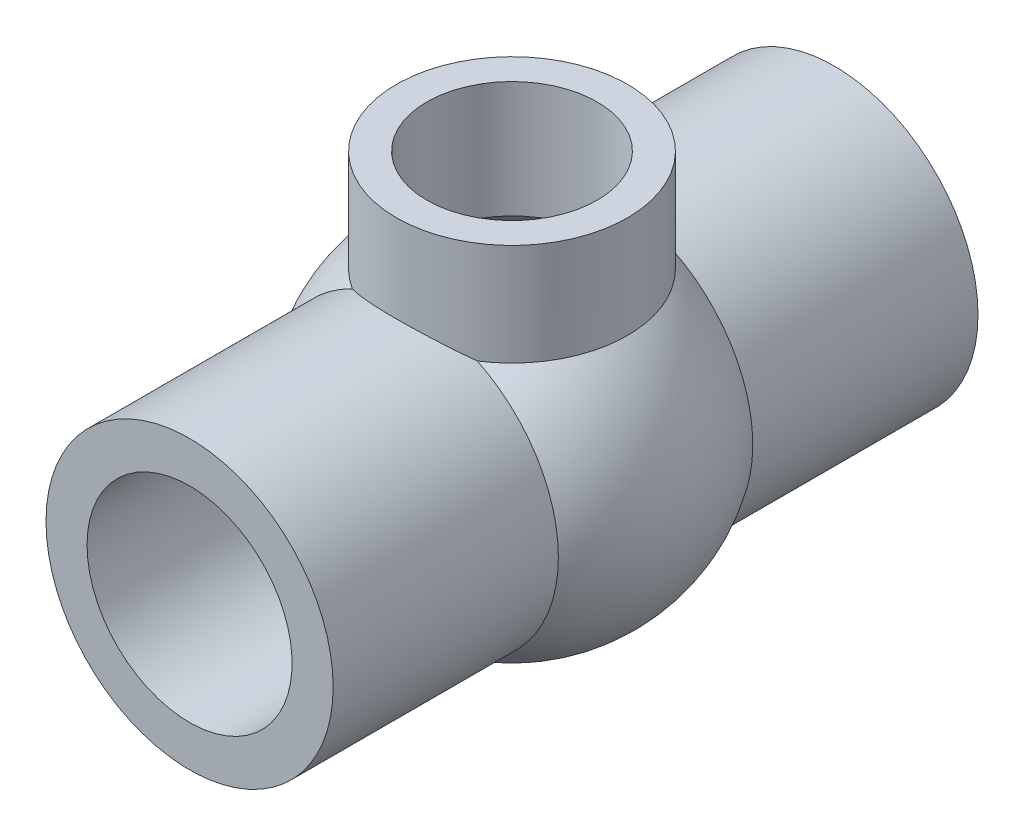
ISO-10303-21;
HEADER;
FILE_DESCRIPTION(('STEP AP214'),'2;1');
FILE_NAME('part.step','',(''),(''),'','','');
FILE_SCHEMA(('AUTOMOTIVE_DESIGN { 1 0 10303 214 1 1 1 1 }'));
ENDSEC;
DATA;
#1=APPLICATION_CONTEXT('core data for automotive mechanical design processes');
#2=APPLICATION_PROTOCOL_DEFINITION('international standard','automotive_design',2000,#1);
#3=PRODUCT_CONTEXT('',#1,'mechanical');
#4=PRODUCT('Part','Part','',(#3));
#5=PRODUCT_RELATED_PRODUCT_CATEGORY('part','',(#4));
#6=PRODUCT_DEFINITION_FORMATION('','',#4);
#7=PRODUCT_DEFINITION_CONTEXT('part definition',#1,'design');
#8=PRODUCT_DEFINITION('design','',#6,#7);
#9=PRODUCT_DEFINITION_SHAPE('','',#8);
#10=(LENGTH_UNIT() NAMED_UNIT(*) SI_UNIT(.MILLI.,.METRE.));
#11=(NAMED_UNIT(*) PLANE_ANGLE_UNIT() SI_UNIT($,.RADIAN.));
#12=(NAMED_UNIT(*) SI_UNIT($,.STERADIAN.) SOLID_ANGLE_UNIT());
#13=UNCERTAINTY_MEASURE_WITH_UNIT(LENGTH_MEASURE(1.E-05),#10,'distance_accuracy_value','');
#14=(GEOMETRIC_REPRESENTATION_CONTEXT(3) GLOBAL_UNCERTAINTY_ASSIGNED_CONTEXT((#13)) GLOBAL_UNIT_ASSIGNED_CONTEXT((#10,
#11,#12)) REPRESENTATION_CONTEXT('',''));
#15=CARTESIAN_POINT('',(0.,0.,0.));
#16=DIRECTION('',(0.,0.,1.));
#17=DIRECTION('',(1.,0.,0.));
#18=AXIS2_PLACEMENT_3D('',#15,#16,#17);
#19=CARTESIAN_POINT('',(9.46564700218448E-08,24.25880268062,-11.8369969783752));
#20=DIRECTION('',(0.,-1.,0.));
#21=DIRECTION('',(0.,0.,-1.));
#22=AXIS2_PLACEMENT_3D('',#19,#20,#21);
#23=PLANE('',#22);
#24=CARTESIAN_POINT('',(9.46564700218448E-08,24.25880268062,3.02162483085456E-06));
#25=DIRECTION('',(0.,1.,0.));
#26=DIRECTION('',(0.,0.,1.));
#27=AXIS2_PLACEMENT_3D('',#24,#25,#26);
#28=CIRCLE('',#27,11.837);
#29=CARTESIAN_POINT('',(9.46564700218448E-08,24.25880268062,11.8370030216248));
#30=VERTEX_POINT('',#29);
#31=EDGE_CURVE('E81',#30,#30,#28,.T.);
#32=ORIENTED_EDGE('',*,*,#31,.T.);
#33=EDGE_LOOP('',(#32));
#34=FACE_BOUND('',#33,.T.);
#35=CARTESIAN_POINT('',(9.46564700218448E-08,24.25880268062,3.02162483085456E-06));
#36=DIRECTION('',(0.,1.,0.));
#37=DIRECTION('',(0.,0.,1.));
#38=AXIS2_PLACEMENT_3D('',#35,#36,#37);
#39=CIRCLE('',#38,8.722);
#40=CARTESIAN_POINT('',(9.46564700218448E-08,24.25880268062,8.72200302162483));
#41=VERTEX_POINT('',#40);
#42=EDGE_CURVE('E134',#41,#41,#39,.T.);
#43=ORIENTED_EDGE('',*,*,#42,.F.);
#44=EDGE_LOOP('',(#43));
#45=FACE_BOUND('',#44,.T.);
#46=ADVANCED_FACE('F39',(#34,#45),#23,.F.);
#47=CARTESIAN_POINT('',(9.46564700218448E-08,0.584802680619981,-33.0189969783752));
#48=DIRECTION('',(0.,0.,-1.));
#49=DIRECTION('',(-1.,0.,0.));
#50=AXIS2_PLACEMENT_3D('',#47,#48,#49);
#51=CYLINDRICAL_SURFACE('',#50,7.7875);
#52=CARTESIAN_POINT('',(9.46564700218448E-08,0.584802680619981,-15.5749969783752));
#53=DIRECTION('',(0.,0.,-1.));
#54=DIRECTION('',(-1.,0.,0.));
#55=AXIS2_PLACEMENT_3D('',#52,#53,#54);
#56=CIRCLE('',#55,7.7875);
#57=CARTESIAN_POINT('',(-7.78749990534353,0.584802680619981,-15.5749969783752));
#58=VERTEX_POINT('',#57);
#59=EDGE_CURVE('E150',#58,#58,#56,.T.);
#60=ORIENTED_EDGE('',*,*,#59,.T.);
#61=EDGE_LOOP('',(#60));
#62=FACE_BOUND('',#61,.T.);
#63=CARTESIAN_POINT('',(9.46564700218448E-08,0.584802680619981,-12.3975404447237));
#64=DIRECTION('',(0.,0.,1.));
#65=DIRECTION('',(1.,0.,0.));
#66=AXIS2_PLACEMENT_3D('',#63,#64,#65);
#67=CIRCLE('',#66,7.7875);
#68=CARTESIAN_POINT('',(7.78750009465647,0.584802680619981,-12.3975404447237));
#69=VERTEX_POINT('',#68);
#70=EDGE_CURVE('E43',#69,#69,#67,.F.);
#71=ORIENTED_EDGE('',*,*,#70,.F.);
#72=EDGE_LOOP('',(#71));
#73=FACE_BOUND('',#72,.T.);
#74=ADVANCED_FACE('F123',(#62,#73),#51,.F.);
#75=CARTESIAN_POINT('',(9.46564700218448E-08,0.584802680619981,15.5750030216248));
#76=DIRECTION('',(0.,0.,-1.));
#77=DIRECTION('',(-1.,0.,0.));
#78=AXIS2_PLACEMENT_3D('',#75,#76,#77);
#79=CIRCLE('',#78,7.7875);
#80=CARTESIAN_POINT('',(-7.78749990534353,0.584802680619981,15.5750030216248));
#81=VERTEX_POINT('',#80);
#82=EDGE_CURVE('E147',#81,#81,#79,.T.);
#83=ORIENTED_EDGE('',*,*,#82,.F.);
#84=EDGE_LOOP('',(#83));
#85=FACE_BOUND('',#84,.T.);
#86=CARTESIAN_POINT('',(9.46564700218448E-08,0.584802680619981,12.3975464879733));
#87=DIRECTION('',(0.,0.,-1.));
#88=DIRECTION('',(-1.,0.,0.));
#89=AXIS2_PLACEMENT_3D('',#86,#87,#88);
#90=CIRCLE('',#89,7.7875);
#91=CARTESIAN_POINT('',(-7.78749990534353,0.584802680619981,12.3975464879733));
#92=VERTEX_POINT('',#91);
#93=EDGE_CURVE('E112',#92,#92,#90,.F.);
#94=ORIENTED_EDGE('',*,*,#93,.F.);
#95=EDGE_LOOP('',(#94));
#96=FACE_BOUND('',#95,.T.);
#97=ADVANCED_FACE('F120',(#85,#96),#51,.F.);
#98=CARTESIAN_POINT('',(9.46564700218448E-08,0.584802680619981,60.8751640437731));
#99=DIRECTION('',(0.,0.,1.));
#100=DIRECTION('',(1.,0.,0.));
#101=AXIS2_PLACEMENT_3D('',#98,#99,#100);
#102=CYLINDRICAL_SURFACE('',#101,14.7028);
#103=CARTESIAN_POINT('',(9.46564700218448E-08,0.584802680619981,-33.0189969783752));
#104=DIRECTION('',(0.,0.,1.));
#105=DIRECTION('',(1.,0.,0.));
#106=AXIS2_PLACEMENT_3D('',#103,#104,#105);
#107=CIRCLE('',#106,14.7028);
#108=CARTESIAN_POINT('',(14.7028000946565,0.584802680619981,-33.0189969783752));
#109=VERTEX_POINT('',#108);
#110=EDGE_CURVE('E48',#109,#109,#107,.T.);
#111=ORIENTED_EDGE('',*,*,#110,.T.);
#112=EDGE_LOOP('',(#111));
#113=FACE_BOUND('',#112,.T.);
#114=CARTESIAN_POINT('',(9.46564700218448E-08,15.28760268062,11.8370030216248));
#115=CARTESIAN_POINT('',(0.283808705634286,15.2876022117409,11.8370025396784));
#116=CARTESIAN_POINT('',(0.567624021275594,15.2793681875885,11.8267795929373));
#117=CARTESIAN_POINT('',(1.13296204156267,15.2466218126209,11.786067950437));
#118=CARTESIAN_POINT('',(1.41448370397799,15.2221024384421,11.7555705109159));
#119=CARTESIAN_POINT('',(1.97327637209859,15.1573025545792,11.6747867710097));
#120=CARTESIAN_POINT('',(2.2505399781478,15.1169972620206,11.624469353823));
#121=CARTESIAN_POINT('',(2.79829456637059,15.0215325357975,11.5049021725606));
#122=CARTESIAN_POINT('',(3.06878612982952,14.9663743818547,11.4356540395464));
#123=CARTESIAN_POINT('',(3.59961799816797,14.8427439480265,11.2797799729303));
#124=CARTESIAN_POINT('',(3.86001158221938,14.7743578653327,11.1932664359468));
#125=CARTESIAN_POINT('',(4.37108318677141,14.6253447925978,11.0037519742995));
#126=CARTESIAN_POINT('',(4.62176120791297,14.5447178033642,10.9007510507233));
#127=CARTESIAN_POINT('',(5.11234156026362,14.3726182465338,10.679466367475));
#128=CARTESIAN_POINT('',(5.35224551698693,14.2811473226237,10.5611849237287));
#129=CARTESIAN_POINT('',(5.82061531048152,14.0887612820144,10.31046363206));
#130=CARTESIAN_POINT('',(6.04907877876074,13.9878442220145,10.1780208700077));
#131=CARTESIAN_POINT('',(6.5722250729289,13.7411182346699,9.8512002688795));
#132=CARTESIAN_POINT('',(6.86197913834814,13.5919921898443,9.65140848655999));
#133=CARTESIAN_POINT('',(7.41893530504116,13.282569881491,9.23016963419127));
#134=CARTESIAN_POINT('',(7.68613008536966,13.1222700224089,9.00871558424016));
#135=CARTESIAN_POINT('',(8.19824895036711,12.7935637502363,8.54534371102611));
#136=CARTESIAN_POINT('',(8.44311266268388,12.6251371403327,8.30337363872808));
#137=CARTESIAN_POINT('',(8.90957553687097,12.2841718877127,7.80074662468107));
#138=CARTESIAN_POINT('',(9.13117738731578,12.111633723039,7.54009184835821));
#139=CARTESIAN_POINT('',(9.55434483794059,11.7634906980284,6.9964052714562));
#140=CARTESIAN_POINT('',(9.75553111908839,11.5878811229385,6.71308112871252));
#141=CARTESIAN_POINT('',(10.1333714000861,11.2409226427811,6.12786881133842));
#142=CARTESIAN_POINT('',(10.3100175356257,11.0695751179363,5.82597473016568));
#143=CARTESIAN_POINT('',(10.6373967498994,10.7372576401059,5.20417727127036));
#144=CARTESIAN_POINT('',(10.7881987621894,10.576260819841,4.88432492098199));
#145=CARTESIAN_POINT('',(11.0627736168144,10.2713608484233,4.22574644809477));
#146=CARTESIAN_POINT('',(11.1865696486431,10.1274430806469,3.88703683409483));
#147=CARTESIAN_POINT('',(11.4202462194479,9.84699663233803,3.14096203190057));
#148=CARTESIAN_POINT('',(11.5257160099681,9.7143587373478,2.73064342108747));
#149=CARTESIAN_POINT('',(11.6512672750039,9.55279906463435,2.09965408299069));
#150=CARTESIAN_POINT('',(11.6876619459316,9.50519815646324,1.8868872317873));
#151=CARTESIAN_POINT('',(11.7489820638734,9.42427876510511,1.45706894545404));
#152=CARTESIAN_POINT('',(11.7739133013241,9.39095307177079,1.24001973135424));
#153=CARTESIAN_POINT('',(11.8119505098967,9.33986947276808,0.80089730124088));
#154=CARTESIAN_POINT('',(11.82493952196,9.32226558932172,0.578795780647014));
#155=CARTESIAN_POINT('',(11.838342239623,9.30409825359001,0.133517241863857));
#156=CARTESIAN_POINT('',(11.8387566297471,9.3035338737257,-0.0896597171203217));
#157=CARTESIAN_POINT('',(11.8269954308411,9.31948088860525,-0.535205740549537));
#158=CARTESIAN_POINT('',(11.814811645745,9.33600339966543,-0.757574184488828));
#159=CARTESIAN_POINT('',(11.7781580388935,9.38527144884505,-1.19947531572197));
#160=CARTESIAN_POINT('',(11.7536865124387,9.41801923791677,-1.41900760521552));
#161=CARTESIAN_POINT('',(11.6885458505343,9.50408215980732,-1.88569027553334));
#162=CARTESIAN_POINT('',(11.6460234071772,9.55971433873336,-2.13215227176159));
#163=CARTESIAN_POINT('',(11.546566650573,9.68731026724855,-2.61779444441229));
#164=CARTESIAN_POINT('',(11.4896293237686,9.75927743148311,-2.85697308645825));
#165=CARTESIAN_POINT('',(11.3622171746549,9.91660879880369,-3.32779222061071));
#166=CARTESIAN_POINT('',(11.2917104637527,10.0020044711906,-3.55941342243446));
#167=CARTESIAN_POINT('',(11.1381140964519,10.1831810827391,-4.01430185907268));
#168=CARTESIAN_POINT('',(11.0550199094961,10.2789657576309,-4.23756604975424));
#169=CARTESIAN_POINT('',(10.8318686981202,10.5288151207282,-4.78666017739817));
#170=CARTESIAN_POINT('',(10.6842716994143,10.6878336054065,-5.1071878046234));
#171=CARTESIAN_POINT('',(10.3637622986171,11.0163665711802,-5.72971294479066));
#172=CARTESIAN_POINT('',(10.1908377400049,11.1858860697949,-6.03170146014308));
#173=CARTESIAN_POINT('',(9.8203874973015,11.5299529197256,-6.61776474564301));
#174=CARTESIAN_POINT('',(9.62283248753742,11.7045060705459,-6.90181754333019));
#175=CARTESIAN_POINT('',(9.20378031800648,12.0537683256009,-7.45146639895967));
#176=CARTESIAN_POINT('',(8.982287221408,12.2284773983928,-7.71706557662172));
#177=CARTESIAN_POINT('',(8.50856188641325,12.5792241452384,-8.2368804351122));
#178=CARTESIAN_POINT('',(8.25560949138329,12.755145835039,-8.49051974367097));
#179=CARTESIAN_POINT('',(7.72463080648325,13.0988926256958,-8.97630569640252));
#180=CARTESIAN_POINT('',(7.4466007909683,13.2667165178029,-9.20844913663518));
#181=CARTESIAN_POINT('',(6.86652496117128,13.5899234822184,-9.64871092012902));
#182=CARTESIAN_POINT('',(6.56453457527914,13.7453336899715,-9.85688213127665));
#183=CARTESIAN_POINT('',(5.9368683639043,14.0401361274388,-10.2471712513416));
#184=CARTESIAN_POINT('',(5.61120306414345,14.1795354052523,-10.4293006327296));
#185=CARTESIAN_POINT('',(5.03345303908494,14.4015833147687,-10.7168741620688));
#186=CARTESIAN_POINT('',(4.78674217417165,14.4891049599204,-10.8294061558499));
#187=CARTESIAN_POINT('',(4.28288345266563,14.6524721910608,-11.0383762223009));
#188=CARTESIAN_POINT('',(4.02573820314143,14.728320671208,-11.1348182846897));
#189=CARTESIAN_POINT('',(3.50229730320667,14.8669420378764,-11.3103747199699));
#190=CARTESIAN_POINT('',(3.23600615350828,14.9297212513738,-11.3894974782867));
#191=CARTESIAN_POINT('',(2.69568313181164,15.0410017240823,-11.529338955079));
#192=CARTESIAN_POINT('',(2.42165106847806,15.0895026300316,-11.5900572182072));
#193=CARTESIAN_POINT('',(1.86617815008518,15.1714044536815,-11.6923936662989));
#194=CARTESIAN_POINT('',(1.58470437117172,15.2047191885241,-11.7339028578074));
#195=CARTESIAN_POINT('',(1.01804575617413,15.25507231279,-11.7965812927353));
#196=CARTESIAN_POINT('',(0.732860924981342,15.2721107236639,-11.817750562961));
#197=CARTESIAN_POINT('',(0.161249473428675,15.2894982832666,-11.8393531695803));
#198=CARTESIAN_POINT('',(-0.125176907526533,15.2898505178512,-11.8397903400621));
#199=CARTESIAN_POINT('',(-0.696828464939259,15.2738634064607,-11.8199285275477));
#200=CARTESIAN_POINT('',(-0.982053709649192,15.2575250221098,-11.7996307391891));
#201=CARTESIAN_POINT('',(-1.52437787185493,15.210676024185,-11.7413206576492));
#202=CARTESIAN_POINT('',(-1.781777585855,15.1815119554838,-11.7049905433351));
#203=CARTESIAN_POINT('',(-2.29185654189788,15.110160894374,-11.6158906060488));
#204=CARTESIAN_POINT('',(-2.54453610698599,15.067974796677,-11.5631219125286));
#205=CARTESIAN_POINT('',(-3.04373297751194,14.9713475340254,-11.4418611234125));
#206=CARTESIAN_POINT('',(-3.29024914991235,14.9169041339079,-11.3733661600299));
#207=CARTESIAN_POINT('',(-3.77582309688841,14.7967011518165,-11.2215143051509));
#208=CARTESIAN_POINT('',(-4.01488046543398,14.7309409550626,-11.1381566062341));
#209=CARTESIAN_POINT('',(-4.49754824395729,14.5852103913938,-10.9524920569922));
#210=CARTESIAN_POINT('',(-4.74067529364551,14.5046540129666,-10.849390424728));
#211=CARTESIAN_POINT('',(-5.21664684544434,14.3333637245987,-10.6287321298952));
#212=CARTESIAN_POINT('',(-5.449487596177,14.2426261436229,-10.5111702519178));
#213=CARTESIAN_POINT('',(-5.90407879241624,14.0523517926006,-10.2627208359955));
#214=CARTESIAN_POINT('',(-6.12583249803418,13.9528176332709,-10.131837250033));
#215=CARTESIAN_POINT('',(-6.55790411157741,13.7462455471507,-9.85768138390135));
#216=CARTESIAN_POINT('',(-6.76822043621667,13.6392065861357,-9.71440739559347));
#217=CARTESIAN_POINT('',(-7.21539368731654,13.3983273118407,-9.38844106754673));
#218=CARTESIAN_POINT('',(-7.44985116625177,13.2632202204315,-9.20338981756587));
#219=CARTESIAN_POINT('',(-7.90189502280209,12.9865205968494,-8.81831768510267));
#220=CARTESIAN_POINT('',(-8.11948456630202,12.8449292896509,-8.61829962560634));
#221=CARTESIAN_POINT('',(-8.53830563943585,12.5570373047859,-8.20359362487561));
#222=CARTESIAN_POINT('',(-8.73949010012449,12.4107246489844,-7.98886651507509));
#223=CARTESIAN_POINT('',(-9.12467509523861,12.1161259794849,-7.54592293801414));
#224=CARTESIAN_POINT('',(-9.30867940587725,11.9678404076611,-7.31770945316488));
#225=CARTESIAN_POINT('',(-9.69787522421546,11.6392935678869,-6.79657850066666));
#226=CARTESIAN_POINT('',(-9.89887338495601,11.4591461614386,-6.50044114284459));
#227=CARTESIAN_POINT('',(-10.274741320814,11.1047241653544,-5.88840014119555));
#228=CARTESIAN_POINT('',(-10.4495977890893,10.9304526014025,-5.57248654600721));
#229=CARTESIAN_POINT('',(-10.7714648554724,10.5948842427801,-4.92154233686032));
#230=CARTESIAN_POINT('',(-10.9185558333985,10.4335507977717,-4.58657067661223));
#231=CARTESIAN_POINT('',(-11.1834283115738,10.1317138698741,-3.89638060916038));
#232=CARTESIAN_POINT('',(-11.3012430723128,9.99118682306436,-3.54118574674614));
#233=CARTESIAN_POINT('',(-11.4579859767321,9.79862657687488,-2.97846303181043));
#234=CARTESIAN_POINT('',(-11.5083260191932,9.73554746730043,-2.77784061982679));
#235=CARTESIAN_POINT('',(-11.5989245924312,9.62043388792727,-2.37125388408934));
#236=CARTESIAN_POINT('',(-11.6391871325197,9.56839502705023,-2.16529172084982));
#237=CARTESIAN_POINT('',(-11.7089415796688,9.47728898989294,-1.74918215799195));
#238=CARTESIAN_POINT('',(-11.7384570793204,9.43819341702677,-1.53904500701798));
#239=CARTESIAN_POINT('',(-11.7862680146446,9.37444489553825,-1.11529940643102));
#240=CARTESIAN_POINT('',(-11.8045635868178,9.34979177121055,-0.901690999081486));
#241=CARTESIAN_POINT('',(-11.8296052410957,9.31596649263404,-0.471013080948931));
#242=CARTESIAN_POINT('',(-11.8362676777029,9.30690646370389,-0.253929738978737));
#243=CARTESIAN_POINT('',(-11.8376177273085,9.30507408872272,0.180336415214354));
#244=CARTESIAN_POINT('',(-11.832305707565,9.31230124314158,0.39751922418233));
#245=CARTESIAN_POINT('',(-11.8098289233899,9.34269151684485,0.830386332096552));
#246=CARTESIAN_POINT('',(-11.7926504492052,9.36587306871983,1.04606860598785));
#247=CARTESIAN_POINT('',(-11.7468308014751,9.42707263739816,1.47407424802946));
#248=CARTESIAN_POINT('',(-11.718187881909,9.46509291409886,1.68639709942129));
#249=CARTESIAN_POINT('',(-11.642352373702,9.564373013965,2.15362255025962));
#250=CARTESIAN_POINT('',(-11.5924387538565,9.6289341449467,2.40738094455584));
#251=CARTESIAN_POINT('',(-11.4774524587193,9.77441526551916,2.90660540935785));
#252=CARTESIAN_POINT('',(-11.4123754520275,9.85533992845511,3.15206908750651));
#253=CARTESIAN_POINT('',(-11.267988049912,10.0303124032001,3.63464302402665));
#254=CARTESIAN_POINT('',(-11.1886429160623,10.1243921162531,3.87173116635197));
#255=CARTESIAN_POINT('',(-11.0167381528607,10.3224110326384,4.33676555289854));
#256=CARTESIAN_POINT('',(-10.9241777854651,10.4263507865249,4.56471128562348));
#257=CARTESIAN_POINT('',(-10.6782314411143,10.6939497714492,5.12077215925111));
#258=CARTESIAN_POINT('',(-10.5172191149718,10.8619799004296,5.44342869250653));
#259=CARTESIAN_POINT('',(-10.1688783201889,11.2067803844078,6.06933727616363));
#260=CARTESIAN_POINT('',(-9.98153807413507,11.3835546278986,6.37258055347553));
#261=CARTESIAN_POINT('',(-9.58111862316684,11.740361631454,6.96011957670121));
#262=CARTESIAN_POINT('',(-9.36801178605447,11.9203977105033,7.24439446484878));
#263=CARTESIAN_POINT('',(-8.91662019420524,12.2787872776056,7.79324777677253));
#264=CARTESIAN_POINT('',(-8.67833964787169,12.4571410414856,8.0578294801816));
#265=CARTESIAN_POINT('',(-8.17164931891097,12.811576662573,8.57155397813277));
#266=CARTESIAN_POINT('',(-7.9027262578032,12.9875389729406,8.82027452584974));
#267=CARTESIAN_POINT('',(-7.33900624743759,13.3292112726812,9.2945834477532));
#268=CARTESIAN_POINT('',(-7.04420503711159,13.4949195659512,9.52016799908164));
#269=CARTESIAN_POINT('',(-6.43005078274666,13.8115130116085,9.94526128137093));
#270=CARTESIAN_POINT('',(-6.11075572214905,13.9624313560504,10.1448287496201));
#271=CARTESIAN_POINT('',(-5.4483007911902,14.2456192210069,10.5154407076129));
#272=CARTESIAN_POINT('',(-5.10515439161299,14.3778991423868,10.6865011150701));
#273=CARTESIAN_POINT('',(-4.50774986344785,14.5819013767169,10.9483115223322));
#274=CARTESIAN_POINT('',(-4.25918737200281,14.6596365212359,11.0474612717677));
#275=CARTESIAN_POINT('',(-3.75283948573051,14.8030198240439,11.2295665343171));
#276=CARTESIAN_POINT('',(-3.49505650852786,14.8686711233873,11.3125262561784));
#277=CARTESIAN_POINT('',(-2.97208118462149,14.9865654709546,11.4610259293069));
#278=CARTESIAN_POINT('',(-2.70690432634663,15.0388345092892,11.526599655419));
#279=CARTESIAN_POINT('',(-2.17039665408885,15.1290681240877,11.6395499883918));
#280=CARTESIAN_POINT('',(-1.89906820610543,15.1670381044679,11.6869334698622));
#281=CARTESIAN_POINT('',(-1.35747994132269,15.2272868230119,11.762021346565));
#282=CARTESIAN_POINT('',(-1.087304202465,15.2498596921093,11.7900947160768));
#283=CARTESIAN_POINT('',(-0.544754697876306,15.280019756651,11.8275881632514));
#284=CARTESIAN_POINT('',(-0.272380389400429,15.2876031306187,11.8370034841647));
#285=CARTESIAN_POINT('',(9.46564700218448E-08,15.28760268062,11.8370030216248));
#286=B_SPLINE_CURVE_WITH_KNOTS('',3,(#114,#115,#116,#117,#118,#119,#120,#121,#122,#123,#124,
#125,#126,#127,#128,#129,#130,#131,#132,#133,#134,#135,#136,#137,#138,#139,#140,#141,#142,#143,
#144,#145,#146,#147,#148,#149,#150,#151,#152,#153,#154,#155,#156,#157,#158,#159,#160,#161,#162,
#163,#164,#165,#166,#167,#168,#169,#170,#171,#172,#173,#174,#175,#176,#177,#178,#179,#180,#181,
#182,#183,#184,#185,#186,#187,#188,#189,#190,#191,#192,#193,#194,#195,#196,#197,#198,#199,#200,
#201,#202,#203,#204,#205,#206,#207,#208,#209,#210,#211,#212,#213,#214,#215,#216,#217,#218,#219,
#220,#221,#222,#223,#224,#225,#226,#227,#228,#229,#230,#231,#232,#233,#234,#235,#236,#237,#238,
#239,#240,#241,#242,#243,#244,#245,#246,#247,#248,#249,#250,#251,#252,#253,#254,#255,#256,#257,
#258,#259,#260,#261,#262,#263,#264,#265,#266,#267,#268,#269,#270,#271,#272,#273,#274,#275,#276,
#277,#278,#279,#280,#281,#282,#283,#284,#285),.UNSPECIFIED.,.T.,.F.,(4,2,2,2,2,2,2,2,2,2,2,2,2,
2,2,2,2,2,2,2,2,2,2,2,2,2,2,2,2,2,2,2,2,2,2,2,2,2,2,2,2,2,2,2,2,2,2,2,2,2,2,2,2,2,2,2,2,2,2,2,2,
2,2,2,2,2,2,2,2,2,2,2,2,2,2,2,2,2,2,2,2,2,2,2,2,4),(0.,0.851137219866172,1.70264174723382,
2.55548847515522,3.40826174534643,4.25565469339856,5.1030475855484,5.95031219660729,
6.79775149537137,7.94286528543693,9.08834927111746,10.2368435700476,11.3852049810669,
12.5520251663054,13.7192184207299,14.8832482784179,16.0462746379342,17.3729891777962,
18.0354567599739,18.6975893463466,19.36613968028,20.0346536202929,20.7036027530102,
21.3726447158395,22.1401149867069,22.9077458366177,23.6772031774906,24.4469381268277,
25.6063890935989,26.7663983992648,27.9278022741189,29.0890093249676,30.2848749978147,
31.4809186274354,32.6742718539919,33.8670977300475,34.7211194817288,35.5749291512553,
36.4283245159264,37.2817409928075,38.1399421629346,38.9981422020253,39.8561835293842,
40.7141754237719,41.4980318265947,42.2818343845524,43.0657799876326,43.8497681916587,
44.6772569555106,45.5050450515572,46.3325882899951,47.1602457958265,48.1428020387584,
49.1251734203479,50.1102708758838,51.0951512938144,52.2958582711938,53.4971743756365,
54.6949575199747,55.8913735856914,56.5396302720034,57.1876286394366,57.8341957784584,
58.4807550512472,59.1319444118235,59.783113800606,60.4350367704637,61.0870590651812,
61.8854879697845,62.6841452246865,63.4847739565405,64.2854474193823,65.4772247786066,
66.6695369692593,67.8631393343345,69.0565424742868,70.2741628314806,71.4919840581641,
72.7070064242372,73.9213480587806,74.7565676456176,75.5915698193266,76.4249377923259,
77.2579905011268,78.0746467873184,78.8915112480099),.UNSPECIFIED.);
#287=CARTESIAN_POINT('',(6.40539755226985,13.8189710054525,-9.9541645683849));
#288=VERTEX_POINT('',#287);
#289=CARTESIAN_POINT('',(-6.40539736295691,13.8189710054525,-9.9541645683849));
#290=VERTEX_POINT('',#289);
#291=EDGE_CURVE('E62',#288,#290,#286,.T.);
#292=ORIENTED_EDGE('',*,*,#291,.F.);
#293=CARTESIAN_POINT('',(9.46564700218448E-08,0.584802680619981,-9.9541645683849));
#294=DIRECTION('',(0.,0.,1.));
#295=DIRECTION('',(1.,0.,0.));
#296=AXIS2_PLACEMENT_3D('',#293,#294,#295);
#297=CIRCLE('',#296,14.7028);
#298=EDGE_CURVE('E72',#290,#288,#297,.T.);
#299=ORIENTED_EDGE('',*,*,#298,.F.);
#300=EDGE_LOOP('',(#292,#299));
#301=FACE_BOUND('',#300,.T.);
#302=ADVANCED_FACE('F92',(#113,#301),#102,.T.);
#303=CARTESIAN_POINT('',(9.46564700218448E-08,0.584802680619981,3.02162483085456E-06));
#304=DIRECTION('',(0.,0.,1.));
#305=DIRECTION('',(0.,1.,0.));
#306=AXIS2_PLACEMENT_3D('',#303,#304,#305);
#307=SPHERICAL_SURFACE('',#306,17.7555);
#308=CARTESIAN_POINT('',(9.46564700218448E-08,13.8189710054525,3.02162483085456E-06));
#309=DIRECTION('',(0.,1.,0.));
#310=DIRECTION('',(0.,0.,1.));
#311=AXIS2_PLACEMENT_3D('',#308,#309,#310);
#312=CIRCLE('',#311,11.837);
#313=CARTESIAN_POINT('',(-6.40539736295691,13.8189710054525,9.95417061163456));
#314=VERTEX_POINT('',#313);
#315=EDGE_CURVE('E56',#290,#314,#312,.T.);
#316=ORIENTED_EDGE('',*,*,#315,.F.);
#317=ORIENTED_EDGE('',*,*,#298,.T.);
#318=CARTESIAN_POINT('',(6.40539755226985,13.8189710054525,9.95417061163456));
#319=VERTEX_POINT('',#318);
#320=EDGE_CURVE('E76',#319,#288,#312,.T.);
#321=ORIENTED_EDGE('',*,*,#320,.F.);
#322=CARTESIAN_POINT('',(9.46564700218448E-08,0.584802680619981,9.95417061163456));
#323=DIRECTION('',(0.,0.,1.));
#324=DIRECTION('',(1.,0.,0.));
#325=AXIS2_PLACEMENT_3D('',#322,#323,#324);
#326=CIRCLE('',#325,14.7028);
#327=EDGE_CURVE('E69',#314,#319,#326,.T.);
#328=ORIENTED_EDGE('',*,*,#327,.F.);
#329=EDGE_LOOP('',(#316,#317,#321,#328));
#330=FACE_BOUND('',#329,.T.);
#331=ADVANCED_FACE('F77',(#330),#307,.T.);
#332=CARTESIAN_POINT('',(9.46564700218448E-08,0.584802680619981,60.8751640437731));
#333=DIRECTION('',(0.,0.,1.));
#334=DIRECTION('',(1.,0.,0.));
#335=AXIS2_PLACEMENT_3D('',#332,#333,#334);
#336=CYLINDRICAL_SURFACE('',#335,14.7028);
#337=CARTESIAN_POINT('',(9.46564700218448E-08,0.584802680619981,33.0190030216248));
#338=DIRECTION('',(0.,0.,1.));
#339=DIRECTION('',(1.,0.,0.));
#340=AXIS2_PLACEMENT_3D('',#337,#338,#339);
#341=CIRCLE('',#340,14.7028);
#342=CARTESIAN_POINT('',(14.7028000946565,0.584802680619981,33.0190030216248));
#343=VERTEX_POINT('',#342);
#344=EDGE_CURVE('E73',#343,#343,#341,.T.);
#345=ORIENTED_EDGE('',*,*,#344,.F.);
#346=EDGE_LOOP('',(#345));
#347=FACE_BOUND('',#346,.T.);
#348=CARTESIAN_POINT('',(-6.40539736295691,13.8189710054525,9.95417061163456));
#349=CARTESIAN_POINT('',(-6.17789197535221,13.9291072138062,10.1005781356925));
#350=CARTESIAN_POINT('',(-5.94386029606752,14.0351156555852,10.2401338510201));
#351=CARTESIAN_POINT('',(-5.46324807400695,14.2373896514425,10.5044172658424));
#352=CARTESIAN_POINT('',(-5.21665669530421,14.3336465708246,10.6291318407002));
#353=CARTESIAN_POINT('',(-4.71044058805306,14.5152299070496,10.8629893617297));
#354=CARTESIAN_POINT('',(-4.45075155873248,14.600493205193,10.9720427653208));
#355=CARTESIAN_POINT('',(-3.92080600970752,14.7578746703064,11.1723823654031));
#356=CARTESIAN_POINT('',(-3.65055229775841,14.829996301451,11.2636732445694));
#357=CARTESIAN_POINT('',(-3.0993533328173,14.9600228435323,11.4276758585502));
#358=CARTESIAN_POINT('',(-2.81835641249256,15.0178453493704,11.5002799961674));
#359=CARTESIAN_POINT('',(-2.24902121503415,15.1174464946655,11.6250359490023));
#360=CARTESIAN_POINT('',(-1.96068239887073,15.1592239524791,11.6771862578966));
#361=CARTESIAN_POINT('',(-1.37988007007848,15.2256163612467,11.7599466991188));
#362=CARTESIAN_POINT('',(-1.08743197412098,15.2502837113844,11.7906225988606));
#363=CARTESIAN_POINT('',(-0.500127672361541,15.2820355083144,11.8300932087706));
#364=CARTESIAN_POINT('',(-0.205271741679465,15.2891219364679,11.8388903846602));
#365=CARTESIAN_POINT('',(0.356838937242872,15.2857053509915,11.8346460745308));
#366=CARTESIAN_POINT('',(0.62412118715692,15.2767703847706,11.823551451585));
#367=CARTESIAN_POINT('',(1.15644089321322,15.2444773617481,11.7834000813542));
#368=CARTESIAN_POINT('',(1.4214784714985,15.2211200949094,11.7543443178676));
#369=CARTESIAN_POINT('',(1.94772847037338,15.1604307228925,11.678688034173));
#370=CARTESIAN_POINT('',(2.20893593663926,15.1230819362159,11.6320665707395));
#371=CARTESIAN_POINT('',(2.72549100450462,15.0351547137037,11.5219825024208));
#372=CARTESIAN_POINT('',(2.98083860826102,14.9845762827378,11.4585199037347));
#373=CARTESIAN_POINT('',(3.48253250728771,14.8715093508322,11.3161017268511));
#374=CARTESIAN_POINT('',(3.72892736306109,14.8091022748944,11.2372519656961));
#375=CARTESIAN_POINT('',(4.21342667153448,14.6731915276376,11.0647111982598));
#376=CARTESIAN_POINT('',(4.4515273960752,14.5996829434885,10.9710136203585));
#377=CARTESIAN_POINT('',(4.91804993535025,14.4428543704488,10.7699514703153));
#378=CARTESIAN_POINT('',(5.14648575484344,14.3595492888163,10.6626076439051));
#379=CARTESIAN_POINT('',(5.5933928658738,14.18421035417,10.4351065042682));
#380=CARTESIAN_POINT('',(5.81186499856764,14.0921772400238,10.3149502755627));
#381=CARTESIAN_POINT('',(6.08945243899346,13.9674737423989,10.1508028277747));
#382=CARTESIAN_POINT('',(6.15335244389899,13.9382098599802,10.1121927181041));
#383=CARTESIAN_POINT('',(6.28012663176729,13.8790579532261,10.0339513866688));
#384=CARTESIAN_POINT('',(6.34300180421849,13.8491706033261,9.99432125845218));
#385=CARTESIAN_POINT('',(6.40539755226985,13.8189710054525,9.95417061163456));
#386=B_SPLINE_CURVE_WITH_KNOTS('',3,(#348,#349,#350,#351,#352,#353,#354,#355,#356,#357,#358,
#359,#360,#361,#362,#363,#364,#365,#366,#367,#368,#369,#370,#371,#372,#373,#374,#375,#376,#377,
#378,#379,#380,#381,#382,#383,#384,#385),.UNSPECIFIED.,.F.,.F.,(4,2,2,2,2,2,2,2,2,2,2,2,2,2,2,2,
2,2,4),(0.,0.876264013498746,1.75329727389266,2.63516073926875,3.5167914059933,4.40339028359942,
5.29005444257728,6.1739910861552,7.05782810599087,7.85982021483503,8.66176839949041,
9.46467577192672,10.2675828488221,11.0651514658172,11.8630740764633,12.6597978341339,
13.4564542056241,13.6970123220569,13.9373224797864),.UNSPECIFIED.);
#387=EDGE_CURVE('E11',#314,#319,#386,.T.);
#388=ORIENTED_EDGE('',*,*,#387,.F.);
#389=ORIENTED_EDGE('',*,*,#327,.T.);
#390=EDGE_LOOP('',(#388,#389));
#391=FACE_BOUND('',#390,.T.);
#392=ADVANCED_FACE('F71',(#347,#391),#336,.T.);
#393=CARTESIAN_POINT('',(9.46564700218448E-08,15.28760268062,-33.0189969783752));
#394=DIRECTION('',(0.,0.,1.));
#395=DIRECTION('',(1.,0.,0.));
#396=AXIS2_PLACEMENT_3D('',#393,#394,#395);
#397=PLANE('',#396);
#398=CARTESIAN_POINT('',(9.46564700218448E-08,0.584802680619981,-33.0189969783752));
#399=DIRECTION('',(0.,0.,-1.));
#400=DIRECTION('',(-1.,0.,0.));
#401=AXIS2_PLACEMENT_3D('',#398,#399,#400);
#402=CIRCLE('',#401,10.49755);
#403=CARTESIAN_POINT('',(-10.4975499053435,0.584802680619981,-33.0189969783752));
#404=VERTEX_POINT('',#403);
#405=EDGE_CURVE('E83',#404,#404,#402,.T.);
#406=ORIENTED_EDGE('',*,*,#405,.F.);
#407=EDGE_LOOP('',(#406));
#408=FACE_BOUND('',#407,.T.);
#409=ORIENTED_EDGE('',*,*,#110,.F.);
#410=EDGE_LOOP('',(#409));
#411=FACE_BOUND('',#410,.T.);
#412=ADVANCED_FACE('F41',(#408,#411),#397,.F.);
#413=CARTESIAN_POINT('',(9.46564700218448E-08,15.28760268062,33.0190030216248));
#414=DIRECTION('',(0.,0.,-1.));
#415=DIRECTION('',(-1.,0.,0.));
#416=AXIS2_PLACEMENT_3D('',#413,#414,#415);
#417=PLANE('',#416);
#418=CARTESIAN_POINT('',(9.46564700218448E-08,0.584802680619981,33.0190030216248));
#419=DIRECTION('',(0.,0.,-1.));
#420=DIRECTION('',(-1.,0.,0.));
#421=AXIS2_PLACEMENT_3D('',#418,#419,#420);
#422=CIRCLE('',#421,10.49755);
#423=CARTESIAN_POINT('',(-10.4975499053435,0.584802680619981,33.0190030216248));
#424=VERTEX_POINT('',#423);
#425=EDGE_CURVE('E141',#424,#424,#422,.T.);
#426=ORIENTED_EDGE('',*,*,#425,.T.);
#427=EDGE_LOOP('',(#426));
#428=FACE_BOUND('',#427,.T.);
#429=ORIENTED_EDGE('',*,*,#344,.T.);
#430=EDGE_LOOP('',(#429));
#431=FACE_BOUND('',#430,.T.);
#432=ADVANCED_FACE('F100',(#428,#431),#417,.F.);
#433=CARTESIAN_POINT('',(9.46564700218448E-08,24.25880268062,3.02162483085456E-06));
#434=DIRECTION('',(0.,1.,0.));
#435=DIRECTION('',(0.,0.,1.));
#436=AXIS2_PLACEMENT_3D('',#433,#434,#435);
#437=CYLINDRICAL_SURFACE('',#436,11.837);
#438=ORIENTED_EDGE('',*,*,#31,.F.);
#439=EDGE_LOOP('',(#438));
#440=FACE_BOUND('',#439,.T.);
#441=ORIENTED_EDGE('',*,*,#320,.T.);
#442=ORIENTED_EDGE('',*,*,#291,.T.);
#443=ORIENTED_EDGE('',*,*,#315,.T.);
#444=ORIENTED_EDGE('',*,*,#387,.T.);
#445=EDGE_LOOP('',(#441,#442,#443,#444));
#446=FACE_BOUND('',#445,.T.);
#447=ADVANCED_FACE('F80',(#440,#446),#437,.T.);
#448=CARTESIAN_POINT('',(9.46564700218448E-08,0.584802680619981,-33.0189969783752));
#449=DIRECTION('',(0.,0.,-1.));
#450=DIRECTION('',(-1.,0.,0.));
#451=AXIS2_PLACEMENT_3D('',#448,#449,#450);
#452=CYLINDRICAL_SURFACE('',#451,10.49755);
#453=CARTESIAN_POINT('',(9.46564700218448E-08,0.584802680619981,-15.5749969783752));
#454=DIRECTION('',(0.,0.,-1.));
#455=DIRECTION('',(-1.,0.,0.));
#456=AXIS2_PLACEMENT_3D('',#453,#454,#455);
#457=CIRCLE('',#456,10.49755);
#458=CARTESIAN_POINT('',(-10.4975499053435,0.584802680619981,-15.5749969783752));
#459=VERTEX_POINT('',#458);
#460=EDGE_CURVE('E153',#459,#459,#457,.T.);
#461=ORIENTED_EDGE('',*,*,#460,.F.);
#462=EDGE_LOOP('',(#461));
#463=FACE_BOUND('',#462,.T.);
#464=ORIENTED_EDGE('',*,*,#405,.T.);
#465=EDGE_LOOP('',(#464));
#466=FACE_BOUND('',#465,.T.);
#467=ADVANCED_FACE('F99',(#463,#466),#452,.F.);
#468=CARTESIAN_POINT('',(9.46564700218448E-08,11.08235268062,-15.5749969783752));
#469=DIRECTION('',(0.,0.,1.));
#470=DIRECTION('',(1.,0.,0.));
#471=AXIS2_PLACEMENT_3D('',#468,#469,#470);
#472=PLANE('',#471);
#473=ORIENTED_EDGE('',*,*,#59,.F.);
#474=EDGE_LOOP('',(#473));
#475=FACE_BOUND('',#474,.T.);
#476=ORIENTED_EDGE('',*,*,#460,.T.);
#477=EDGE_LOOP('',(#476));
#478=FACE_BOUND('',#477,.T.);
#479=ADVANCED_FACE('F184',(#475,#478),#472,.F.);
#480=CARTESIAN_POINT('',(9.46564700218448E-08,11.08235268062,15.5750030216248));
#481=DIRECTION('',(0.,0.,-1.));
#482=DIRECTION('',(-1.,0.,0.));
#483=AXIS2_PLACEMENT_3D('',#480,#481,#482);
#484=PLANE('',#483);
#485=CARTESIAN_POINT('',(9.46564700218448E-08,0.584802680619981,15.5750030216248));
#486=DIRECTION('',(0.,0.,-1.));
#487=DIRECTION('',(-1.,0.,0.));
#488=AXIS2_PLACEMENT_3D('',#485,#486,#487);
#489=CIRCLE('',#488,10.49755);
#490=CARTESIAN_POINT('',(-10.4975499053435,0.584802680619981,15.5750030216248));
#491=VERTEX_POINT('',#490);
#492=EDGE_CURVE('E144',#491,#491,#489,.T.);
#493=ORIENTED_EDGE('',*,*,#492,.F.);
#494=EDGE_LOOP('',(#493));
#495=FACE_BOUND('',#494,.T.);
#496=ORIENTED_EDGE('',*,*,#82,.T.);
#497=EDGE_LOOP('',(#496));
#498=FACE_BOUND('',#497,.T.);
#499=ADVANCED_FACE('F178',(#495,#498),#484,.F.);
#500=CARTESIAN_POINT('',(9.46564700218448E-08,0.584802680619981,-33.0189969783752));
#501=DIRECTION('',(0.,0.,-1.));
#502=DIRECTION('',(-1.,0.,0.));
#503=AXIS2_PLACEMENT_3D('',#500,#501,#502);
#504=CYLINDRICAL_SURFACE('',#503,10.49755);
#505=ORIENTED_EDGE('',*,*,#425,.F.);
#506=EDGE_LOOP('',(#505));
#507=FACE_BOUND('',#506,.T.);
#508=ORIENTED_EDGE('',*,*,#492,.T.);
#509=EDGE_LOOP('',(#508));
#510=FACE_BOUND('',#509,.T.);
#511=ADVANCED_FACE('F174',(#507,#510),#504,.F.);
#512=CARTESIAN_POINT('',(9.46564700218448E-08,0.584802680619981,3.02162483085456E-06));
#513=DIRECTION('',(0.,1.,0.));
#514=DIRECTION('',(0.,0.,1.));
#515=AXIS2_PLACEMENT_3D('',#512,#513,#514);
#516=SPHERICAL_SURFACE('',#515,14.6405);
#517=ORIENTED_EDGE('',*,*,#93,.T.);
#518=EDGE_LOOP('',(#517));
#519=FACE_BOUND('',#518,.T.);
#520=CARTESIAN_POINT('',(9.46564700218448E-08,12.3436698135542,3.02162483085456E-06));
#521=DIRECTION('',(0.,1.,0.));
#522=DIRECTION('',(0.,0.,1.));
#523=AXIS2_PLACEMENT_3D('',#520,#521,#522);
#524=CIRCLE('',#523,8.722);
#525=CARTESIAN_POINT('',(9.46564700218448E-08,12.3436698135542,8.72200302162483));
#526=VERTEX_POINT('',#525);
#527=EDGE_CURVE('E136',#526,#526,#524,.T.);
#528=ORIENTED_EDGE('',*,*,#527,.T.);
#529=EDGE_LOOP('',(#528));
#530=FACE_BOUND('',#529,.T.);
#531=ORIENTED_EDGE('',*,*,#70,.T.);
#532=EDGE_LOOP('',(#531));
#533=FACE_BOUND('',#532,.T.);
#534=ADVANCED_FACE('F177',(#519,#530,#533),#516,.F.);
#535=CARTESIAN_POINT('',(9.46564700218448E-08,36.8455835853146,3.02162483085456E-06));
#536=DIRECTION('',(0.,1.,0.));
#537=DIRECTION('',(0.,0.,1.));
#538=AXIS2_PLACEMENT_3D('',#535,#536,#537);
#539=CYLINDRICAL_SURFACE('',#538,8.722);
#540=ORIENTED_EDGE('',*,*,#42,.T.);
#541=EDGE_LOOP('',(#540));
#542=FACE_BOUND('',#541,.T.);
#543=ORIENTED_EDGE('',*,*,#527,.F.);
#544=EDGE_LOOP('',(#543));
#545=FACE_BOUND('',#544,.T.);
#546=ADVANCED_FACE('F198',(#542,#545),#539,.F.);
#547=CLOSED_SHELL('',(#46,#74,#97,#302,#331,#392,#412,#432,#447,#467,#479,#499,#511,#534,#546));
#548=MANIFOLD_SOLID_BREP('B2',#547);
#549=ADVANCED_BREP_SHAPE_REPRESENTATION('',(#18,#548),#14);
#550=SHAPE_DEFINITION_REPRESENTATION(#9,#549);
ENDSEC;
END-ISO-10303-21;
